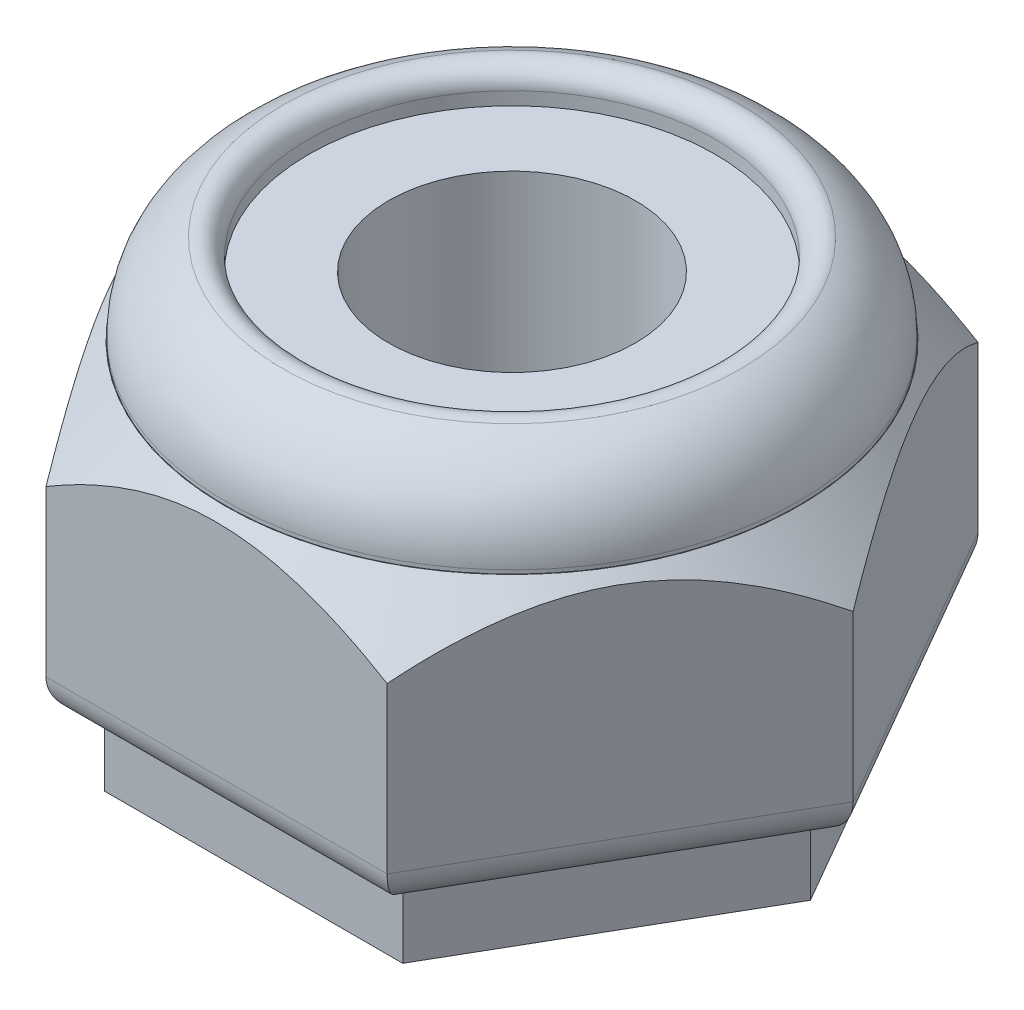
ISO-10303-21;
HEADER;
FILE_DESCRIPTION(('STEP AP214'),'2;1');
FILE_NAME('part.step','',(''),(''),'','','');
FILE_SCHEMA(('AUTOMOTIVE_DESIGN { 1 0 10303 214 1 1 1 1 }'));
ENDSEC;
DATA;
#1=APPLICATION_CONTEXT('core data for automotive mechanical design processes');
#2=APPLICATION_PROTOCOL_DEFINITION('international standard','automotive_design',2000,#1);
#3=PRODUCT_CONTEXT('',#1,'mechanical');
#4=PRODUCT('Part','Part','',(#3));
#5=PRODUCT_RELATED_PRODUCT_CATEGORY('part','',(#4));
#6=PRODUCT_DEFINITION_FORMATION('','',#4);
#7=PRODUCT_DEFINITION_CONTEXT('part definition',#1,'design');
#8=PRODUCT_DEFINITION('design','',#6,#7);
#9=PRODUCT_DEFINITION_SHAPE('','',#8);
#10=(LENGTH_UNIT() NAMED_UNIT(*) SI_UNIT(.MILLI.,.METRE.));
#11=(NAMED_UNIT(*) PLANE_ANGLE_UNIT() SI_UNIT($,.RADIAN.));
#12=(NAMED_UNIT(*) SI_UNIT($,.STERADIAN.) SOLID_ANGLE_UNIT());
#13=UNCERTAINTY_MEASURE_WITH_UNIT(LENGTH_MEASURE(1.E-05),#10,'distance_accuracy_value','');
#14=(GEOMETRIC_REPRESENTATION_CONTEXT(3) GLOBAL_UNCERTAINTY_ASSIGNED_CONTEXT((#13)) GLOBAL_UNIT_ASSIGNED_CONTEXT((#10,
#11,#12)) REPRESENTATION_CONTEXT('',''));
#15=CARTESIAN_POINT('',(0.,0.,0.));
#16=DIRECTION('',(0.,0.,1.));
#17=DIRECTION('',(1.,0.,0.));
#18=AXIS2_PLACEMENT_3D('',#15,#16,#17);
#19=CARTESIAN_POINT('',(0.,4.97840000000001,0.));
#20=DIRECTION('',(0.,-1.,0.));
#21=DIRECTION('',(1.,0.,0.));
#22=AXIS2_PLACEMENT_3D('',#19,#20,#21);
#23=CYLINDRICAL_SURFACE('',#22,3.93700000000001);
#24=CARTESIAN_POINT('',(0.,3.7084,0.));
#25=DIRECTION('',(0.,1.,0.));
#26=DIRECTION('',(-1.,0.,0.));
#27=AXIS2_PLACEMENT_3D('',#24,#25,#26);
#28=CIRCLE('',#27,3.937);
#29=CARTESIAN_POINT('',(-3.937,3.7084,0.));
#30=VERTEX_POINT('',#29);
#31=EDGE_CURVE('E142',#30,#30,#28,.T.);
#32=ORIENTED_EDGE('',*,*,#31,.F.);
#33=EDGE_LOOP('',(#32));
#34=FACE_BOUND('',#33,.T.);
#35=CARTESIAN_POINT('',(0.,3.6576,0.));
#36=DIRECTION('',(0.,-1.,0.));
#37=DIRECTION('',(1.,0.,0.));
#38=AXIS2_PLACEMENT_3D('',#35,#36,#37);
#39=CIRCLE('',#38,3.93700000000001);
#40=CARTESIAN_POINT('',(3.93700000000001,3.6576,0.));
#41=VERTEX_POINT('',#40);
#42=EDGE_CURVE('E20',#41,#41,#39,.F.);
#43=ORIENTED_EDGE('',*,*,#42,.T.);
#44=EDGE_LOOP('',(#43));
#45=FACE_BOUND('',#44,.T.);
#46=ADVANCED_FACE('F16',(#34,#45),#23,.T.);
#47=CARTESIAN_POINT('',(2.34315000000001,3.6576,4.05845484975502));
#48=DIRECTION('',(0.,-1.,0.));
#49=DIRECTION('',(1.,0.,0.));
#50=AXIS2_PLACEMENT_3D('',#47,#48,#49);
#51=PLANE('',#50);
#52=CARTESIAN_POINT('',(0.,3.65760000016735,0.));
#53=DIRECTION('',(0.,-1.,0.));
#54=DIRECTION('',(0.,0.,-1.));
#55=AXIS2_PLACEMENT_3D('',#52,#53,#54);
#56=CIRCLE('',#55,3.94407100938664);
#57=CARTESIAN_POINT('',(0.,3.65760000016735,-3.94407100938664));
#58=VERTEX_POINT('',#57);
#59=EDGE_CURVE('E141',#58,#58,#56,.T.);
#60=ORIENTED_EDGE('',*,*,#59,.F.);
#61=EDGE_LOOP('',(#60));
#62=FACE_BOUND('',#61,.T.);
#63=ORIENTED_EDGE('',*,*,#42,.F.);
#64=EDGE_LOOP('',(#63));
#65=FACE_BOUND('',#64,.T.);
#66=ADVANCED_FACE('F200',(#62,#65),#51,.F.);
#67=CARTESIAN_POINT('',(0.,3.70840000000008,0.));
#68=DIRECTION('',(0.,1.,0.));
#69=DIRECTION('',(0.,0.,1.));
#70=AXIS2_PLACEMENT_3D('',#67,#68,#69);
#71=TOROIDAL_SURFACE('',#70,2.66699999999999,1.27000000000001);
#72=ORIENTED_EDGE('',*,*,#31,.T.);
#73=EDGE_LOOP('',(#72));
#74=FACE_BOUND('',#73,.T.);
#75=CARTESIAN_POINT('',(0.,4.88572150982652,0.));
#76=DIRECTION('',(0.,1.,0.));
#77=DIRECTION('',(-1.,0.,0.));
#78=AXIS2_PLACEMENT_3D('',#75,#76,#77);
#79=CIRCLE('',#78,3.14325000000004);
#80=CARTESIAN_POINT('',(-3.14325000000003,4.88572150982652,0.));
#81=VERTEX_POINT('',#80);
#82=EDGE_CURVE('E121',#81,#81,#79,.T.);
#83=ORIENTED_EDGE('',*,*,#82,.F.);
#84=EDGE_LOOP('',(#83));
#85=FACE_BOUND('',#84,.T.);
#86=ADVANCED_FACE('F197',(#74,#85),#71,.T.);
#87=CARTESIAN_POINT('',(0.,2.76773860986168,0.));
#88=DIRECTION('',(0.,-1.,0.));
#89=DIRECTION('',(0.,0.,-1.));
#90=AXIS2_PLACEMENT_3D('',#87,#88,#89);
#91=CONICAL_SURFACE('',#90,4.69075337383629,0.698131700827581);
#92=CARTESIAN_POINT('',(-4.68630000002063,2.77304593408968,-5.5851817155357E-11));
#93=CARTESIAN_POINT('',(-4.65177717141987,2.81418235899122,0.0597952931143583));
#94=CARTESIAN_POINT('',(-4.61695780288894,2.85432113120693,0.120104208502788));
#95=CARTESIAN_POINT('',(-4.54666264441,2.93230661030783,0.241858994518482));
#96=CARTESIAN_POINT('',(-4.51118655193937,2.9701522247184,0.303305389130307));
#97=CARTESIAN_POINT('',(-4.40329561884235,3.0801870150985,0.490177966928205));
#98=CARTESIAN_POINT('',(-4.32983334003035,3.14837015585763,0.617418366271436));
#99=CARTESIAN_POINT('',(-4.17977964995295,3.27092778618679,0.877318981349457));
#100=CARTESIAN_POINT('',(-4.10317943930135,3.32525984895606,1.00999443806823));
#101=CARTESIAN_POINT('',(-3.94747591648453,3.41577217654512,1.2796808505042));
#102=CARTESIAN_POINT('',(-3.86837998240626,3.45200143021415,1.41667902699998));
#103=CARTESIAN_POINT('',(-3.73746585192525,3.49372811251008,1.64342895242181));
#104=CARTESIAN_POINT('',(-3.68614686015525,3.50560413722607,1.73231605356066));
#105=CARTESIAN_POINT('',(-3.58316406703978,3.52008140709636,1.910687483542));
#106=CARTESIAN_POINT('',(-3.53150020829175,3.52268106759616,2.00017191180866));
#107=CARTESIAN_POINT('',(-3.4285503454563,3.51847006530652,2.1784863048719));
#108=CARTESIAN_POINT('',(-3.37726380879505,3.51171021123823,2.26731719211343));
#109=CARTESIAN_POINT('',(-3.27519197702569,3.48921023560211,2.44411079075957));
#110=CARTESIAN_POINT('',(-3.224406707084,3.47346966546141,2.53207345857468));
#111=CARTESIAN_POINT('',(-3.10963060126893,3.42817062225528,2.73087150534129));
#112=CARTESIAN_POINT('',(-3.04589899568911,3.39598542078789,2.84125788425347));
#113=CARTESIAN_POINT('',(-2.92018166730183,3.32004827847368,3.05900668441208));
#114=CARTESIAN_POINT('',(-2.85819691952129,3.27629001415344,3.16636741686231));
#115=CARTESIAN_POINT('',(-2.7358890681865,3.1791036138555,3.37821082953874));
#116=CARTESIAN_POINT('',(-2.67557364726428,3.12563730729643,3.48268020305593));
#117=CARTESIAN_POINT('',(-2.55683004307658,3.01104764605198,3.68835015858288));
#118=CARTESIAN_POINT('',(-2.49840123076285,2.94992687744367,3.78955183013616));
#119=CARTESIAN_POINT('',(-2.42439626080902,2.86741854621722,3.91773219810881));
#120=CARTESIAN_POINT('',(-2.40802320097242,2.84883596647861,3.94609116962116));
#121=CARTESIAN_POINT('',(-2.3754621575828,2.81125673911825,4.00248855111944));
#122=CARTESIAN_POINT('',(-2.35927376439136,2.7922615116873,4.03052767061991));
#123=CARTESIAN_POINT('',(-2.34314999996957,2.77304593409365,4.05845484980773));
#124=B_SPLINE_CURVE_WITH_KNOTS('',3,(#92,#93,#94,#95,#96,#97,#98,#99,#100,#101,#102,#103,#104,
#105,#106,#107,#108,#109,#110,#111,#112,#113,#114,#115,#116,#117,#118,#119,#120,#121,#122,#123),
.UNSPECIFIED.,.F.,.F.,(4,2,2,2,2,2,2,2,2,2,2,2,2,2,2,4),(0.,0.241096809096306,0.482307589468028,
0.967637153878541,1.45443592247298,1.93991010962832,2.24950193441283,2.55914664334294,
2.86711700082692,3.17510274230014,3.56882084728694,3.96275452424868,4.35827201956431,
4.75365624709085,4.86660838996671,4.97921936903169),.UNSPECIFIED.);
#125=CARTESIAN_POINT('',(-4.68630000003129,2.77304593409263,1.36258849487727E-12));
#126=VERTEX_POINT('',#125);
#127=CARTESIAN_POINT('',(-2.34314999998476,2.77304593411176,4.05845484978141));
#128=VERTEX_POINT('',#127);
#129=EDGE_CURVE('E107',#126,#128,#124,.T.);
#130=ORIENTED_EDGE('',*,*,#129,.T.);
#131=CARTESIAN_POINT('',(-2.34315000006155,2.77304593408735,4.0584548497437));
#132=CARTESIAN_POINT('',(-2.27415972170866,2.81414935281164,4.05845484975083));
#133=CARTESIAN_POINT('',(-2.20457738522182,2.85425669894478,4.05845484975385));
#134=CARTESIAN_POINT('',(-2.06410193527611,2.93218331977878,4.05845484975614));
#135=CARTESIAN_POINT('',(-1.99320821640363,2.9700015014107,4.05845484975539));
#136=CARTESIAN_POINT('',(-1.77754688770714,3.07999086395974,4.05845484975419));
#137=CARTESIAN_POINT('',(-1.63068545867608,3.14815894046428,4.05845484975478));
#138=CARTESIAN_POINT('',(-1.3305275245436,3.27077676928304,4.05845484975521));
#139=CARTESIAN_POINT('',(-1.17720631605115,3.32516696813021,4.05845484975505));
#140=CARTESIAN_POINT('',(-0.86561350375334,3.41574608774384,4.05845484975494));
#141=CARTESIAN_POINT('',(-0.707359229251527,3.45199244882939,4.05845484975499));
#142=CARTESIAN_POINT('',(-0.456822143289689,3.49192146554132,4.058454849755));
#143=CARTESIAN_POINT('',(-0.365672921111748,3.50290887302486,4.058454849755));
#144=CARTESIAN_POINT('',(-0.183016321982132,3.51758027920227,4.058454849755));
#145=CARTESIAN_POINT('',(-0.0915105175139071,3.52128341043631,4.058454849755));
#146=CARTESIAN_POINT('',(0.104649468639837,3.52128177498356,4.058454849755));
#147=CARTESIAN_POINT('',(0.209305100868819,3.51643705340132,4.058454849755));
#148=CARTESIAN_POINT('',(0.417787181903716,3.49730239566766,4.058454849755));
#149=CARTESIAN_POINT('',(0.521613181345373,3.48300765118378,4.058454849755));
#150=CARTESIAN_POINT('',(0.728332544903489,3.44553375893286,4.058454849755));
#151=CARTESIAN_POINT('',(0.831215331547278,3.4222969773141,4.058454849755));
#152=CARTESIAN_POINT('',(1.03487580389782,3.36791830062304,4.058454849755));
#153=CARTESIAN_POINT('',(1.13565289467374,3.33677420329568,4.058454849755));
#154=CARTESIAN_POINT('',(1.33273383820815,3.26838741926302,4.058454849755));
#155=CARTESIAN_POINT('',(1.42908716224858,3.23128582693013,4.058454849755));
#156=CARTESIAN_POINT('',(1.61947291707491,3.15151071600647,4.058454849755));
#157=CARTESIAN_POINT('',(1.71350470709176,3.10883567908223,4.058454849755));
#158=CARTESIAN_POINT('',(1.89803195382149,3.01941532340772,4.058454849755));
#159=CARTESIAN_POINT('',(1.98855798046384,2.9727325573531,4.058454849755));
#160=CARTESIAN_POINT('',(2.16742834958516,2.87556944094008,4.058454849755));
#161=CARTESIAN_POINT('',(2.25577492893011,2.8250932194195,4.058454849755));
#162=CARTESIAN_POINT('',(2.34315000006327,2.77304593409223,4.058454849755));
#163=B_SPLINE_CURVE_WITH_KNOTS('',3,(#131,#132,#133,#134,#135,#136,#137,#138,#139,#140,#141,
#142,#143,#144,#145,#146,#147,#148,#149,#150,#151,#152,#153,#154,#155,#156,#157,#158,#159,#160,
#161,#162),.UNSPECIFIED.,.F.,.F.,(4,2,2,2,2,2,2,2,2,2,2,2,2,2,2,4),(0.,0.240903303567016,
0.481920744751272,0.967059466998938,1.45426068379578,1.93990959183257,2.21507934698528,
2.48952538388813,2.80337599595386,3.11738642358903,3.43345557970446,3.74961286053018,
4.05916118105052,4.36879400618447,4.67425708544416,4.97939238066899),.UNSPECIFIED.);
#164=CARTESIAN_POINT('',(2.34315000001685,2.77304593409264,4.05845484978141));
#165=VERTEX_POINT('',#164);
#166=EDGE_CURVE('E175',#128,#165,#163,.T.);
#167=ORIENTED_EDGE('',*,*,#166,.T.);
#168=CARTESIAN_POINT('',(2.34314999996197,2.77304593408969,4.05845484980079));
#169=CARTESIAN_POINT('',(2.37767282857373,2.81418235899124,3.99865955663693));
#170=CARTESIAN_POINT('',(2.41249219710932,2.85432113120694,3.93835064125119));
#171=CARTESIAN_POINT('',(2.48278735559178,2.93230661030784,3.81659585523753));
#172=CARTESIAN_POINT('',(2.51826344806127,2.97015222471841,3.75514946062505));
#173=CARTESIAN_POINT('',(2.62615438115643,3.0801870150985,3.56827688282608));
#174=CARTESIAN_POINT('',(2.69961665996934,3.14837015585764,3.44103648348338));
#175=CARTESIAN_POINT('',(2.8496703500474,3.27092778618679,3.18113586840574));
#176=CARTESIAN_POINT('',(2.92627056069876,3.32525984895606,3.04846041168683));
#177=CARTESIAN_POINT('',(3.08197408351539,3.41577217654512,2.77877399925076));
#178=CARTESIAN_POINT('',(3.16107001759374,3.45200143021415,2.64177582275502));
#179=CARTESIAN_POINT('',(3.29198414807477,3.49372811251008,2.4150258973332));
#180=CARTESIAN_POINT('',(3.34330313984477,3.50560413722607,2.32613879619435));
#181=CARTESIAN_POINT('',(3.44628593296023,3.52008140709636,2.147767366213));
#182=CARTESIAN_POINT('',(3.49794979170827,3.52268106759615,2.05828293794635));
#183=CARTESIAN_POINT('',(3.60089965454371,3.51847006530651,1.87996854488311));
#184=CARTESIAN_POINT('',(3.65218619120497,3.51171021123823,1.79113765764158));
#185=CARTESIAN_POINT('',(3.75425802297432,3.48921023560211,1.61434405899544));
#186=CARTESIAN_POINT('',(3.80504329291601,3.47346966546141,1.52638139118033));
#187=CARTESIAN_POINT('',(3.91981939873108,3.42817062225528,1.32758334441373));
#188=CARTESIAN_POINT('',(3.98355100431089,3.39598542078789,1.21719696550155));
#189=CARTESIAN_POINT('',(4.10926833269818,3.32004827847368,0.999448165342945));
#190=CARTESIAN_POINT('',(4.17125308047872,3.27629001415344,0.892087432892712));
#191=CARTESIAN_POINT('',(4.2935609318135,3.17910361385551,0.680244020216284));
#192=CARTESIAN_POINT('',(4.35387635273573,3.12563730729643,0.575774646699087));
#193=CARTESIAN_POINT('',(4.47261995692343,3.01104764605197,0.370104691172138));
#194=CARTESIAN_POINT('',(4.53104876923716,2.94992687744367,0.268903019618855));
#195=CARTESIAN_POINT('',(4.60505373919152,2.86741854621663,0.14072265164529));
#196=CARTESIAN_POINT('',(4.62142679902863,2.84883596647742,0.112363680132042));
#197=CARTESIAN_POINT('',(4.65398784241929,2.81125673911583,0.055966298631973));
#198=CARTESIAN_POINT('',(4.67017623561123,2.79226151168425,0.0279271791306273));
#199=CARTESIAN_POINT('',(4.68630000003353,2.77304593408996,-5.80666998558344E-11));
#200=B_SPLINE_CURVE_WITH_KNOTS('',3,(#168,#169,#170,#171,#172,#173,#174,#175,#176,#177,#178,
#179,#180,#181,#182,#183,#184,#185,#186,#187,#188,#189,#190,#191,#192,#193,#194,#195,#196,#197,
#198,#199),.UNSPECIFIED.,.F.,.F.,(4,2,2,2,2,2,2,2,2,2,2,2,2,2,2,4),(0.,0.241096809096303,
0.482307589468021,0.967637153878527,1.45443592247296,1.9399101096283,2.24950193441281,
2.55914664334292,2.8671170008269,3.17510274230012,3.56882084728691,3.96275452424864,
4.35827201956428,4.75365624709083,4.86660838997029,4.97921936903886),.UNSPECIFIED.);
#201=CARTESIAN_POINT('',(4.68630000002732,2.77304593409736,-1.0917840877275E-11));
#202=VERTEX_POINT('',#201);
#203=EDGE_CURVE('E183',#165,#202,#200,.T.);
#204=ORIENTED_EDGE('',*,*,#203,.T.);
#205=CARTESIAN_POINT('',(4.68630000001692,2.77304593410323,3.76267458844408E-11));
#206=CARTESIAN_POINT('',(4.65177717141278,2.8141823590028,-0.0597952931310414));
#207=CARTESIAN_POINT('',(4.61695780288054,2.85432113121737,-0.120104208518577));
#208=CARTESIAN_POINT('',(4.54666264440093,2.93230661031677,-0.241858994533079));
#209=CARTESIAN_POINT('',(4.51118655193091,2.97015222472698,-0.303305389144605));
#210=CARTESIAN_POINT('',(4.40329561883524,3.08018701510582,-0.490177966941427));
#211=CARTESIAN_POINT('',(4.32983334002344,3.14837015586387,-0.617418366283689));
#212=CARTESIAN_POINT('',(4.17977964994688,3.27092778619112,-0.877318981359809));
#213=CARTESIAN_POINT('',(4.10317943929591,3.32525984895958,-1.00999443807765));
#214=CARTESIAN_POINT('',(3.94747591648032,3.41577217654717,-1.27968085051162));
#215=CARTESIAN_POINT('',(3.86837998240263,3.45200143021556,-1.41667902700633));
#216=CARTESIAN_POINT('',(3.73746585192226,3.49372811251083,-1.64342895242706));
#217=CARTESIAN_POINT('',(3.68614686015226,3.50560413722664,-1.7323160535659));
#218=CARTESIAN_POINT('',(3.58316406703681,3.52008140709656,-1.91068748354721));
#219=CARTESIAN_POINT('',(3.53150020828879,3.52268106759618,-2.00017191181384));
#220=CARTESIAN_POINT('',(3.42855034545338,3.51847006530618,-2.17848630487702));
#221=CARTESIAN_POINT('',(3.37726380879215,3.51171021123772,-2.26731719211852));
#222=CARTESIAN_POINT('',(3.27519197702284,3.48921023560127,-2.44411079076458));
#223=CARTESIAN_POINT('',(3.22440670708118,3.47346966546041,-2.53207345857964));
#224=CARTESIAN_POINT('',(3.10963060126602,3.42817062225387,-2.73087150534641));
#225=CARTESIAN_POINT('',(3.04589899568608,3.39598542078622,-2.84125788425879));
#226=CARTESIAN_POINT('',(2.92018166729857,3.32004827847145,-3.05900668441778));
#227=CARTESIAN_POINT('',(2.85819691951793,3.27629001415092,-3.1663674168682));
#228=CARTESIAN_POINT('',(2.73588906818295,3.17910361385241,-3.37821082954497));
#229=CARTESIAN_POINT('',(2.67557364726063,3.12563730729304,-3.48268020306233));
#230=CARTESIAN_POINT('',(2.55683004307275,3.01104764604801,-3.68835015858959));
#231=CARTESIAN_POINT('',(2.49840123075893,2.94992687743942,-3.78955183014302));
#232=CARTESIAN_POINT('',(2.42439626080543,2.8674185462131,-3.91773219811509));
#233=CARTESIAN_POINT('',(2.40802320096925,2.84883596647492,-3.94609116962672));
#234=CARTESIAN_POINT('',(2.37546215758045,2.81125673911543,-4.00248855112358));
#235=CARTESIAN_POINT('',(2.35927376438942,2.79226151168493,-4.03052767062335));
#236=CARTESIAN_POINT('',(2.34314999996803,2.77304593409174,-4.05845484981047));
#237=B_SPLINE_CURVE_WITH_KNOTS('',3,(#205,#206,#207,#208,#209,#210,#211,#212,#213,#214,#215,
#216,#217,#218,#219,#220,#221,#222,#223,#224,#225,#226,#227,#228,#229,#230,#231,#232,#233,#234,
#235,#236),.UNSPECIFIED.,.F.,.F.,(4,2,2,2,2,2,2,2,2,2,2,2,2,2,2,4),(0.,0.241096809094276,
0.482307589464009,0.967637153870556,1.45443592246103,1.93991010961239,2.2495019343968,
2.55914664332681,2.86711700081071,3.17510274228384,3.56882084727151,3.96275452423413,
4.35827201955063,4.75365624707804,4.86660838995109,4.97921936901329),.UNSPECIFIED.);
#238=CARTESIAN_POINT('',(2.34315000001448,2.77304593409259,-4.05845484978282));
#239=VERTEX_POINT('',#238);
#240=EDGE_CURVE('E204',#202,#239,#237,.T.);
#241=ORIENTED_EDGE('',*,*,#240,.T.);
#242=CARTESIAN_POINT('',(2.34315000005868,2.77304593408962,-4.058454849745));
#243=CARTESIAN_POINT('',(2.2741597217057,2.81414935281353,-4.05845484975135));
#244=CARTESIAN_POINT('',(2.20457738521886,2.85425669894645,-4.05845484975405));
#245=CARTESIAN_POINT('',(2.06410193527325,2.93218331978018,-4.05845484975609));
#246=CARTESIAN_POINT('',(1.99320821640086,2.97000150141205,-4.05845484975542));
#247=CARTESIAN_POINT('',(1.77754688770464,3.07999086396089,-4.05845484975435));
#248=CARTESIAN_POINT('',(1.63068545867372,3.14815894046526,-4.05845484975488));
#249=CARTESIAN_POINT('',(1.33052752454156,3.2707767692837,-4.05845484975526));
#250=CARTESIAN_POINT('',(1.17720631604929,3.32516696813074,-4.05845484975512));
#251=CARTESIAN_POINT('',(0.865613503751842,3.41574608774412,-4.05845484975502));
#252=CARTESIAN_POINT('',(0.707359229250219,3.45199244882957,-4.05845484975506));
#253=CARTESIAN_POINT('',(0.456822143288761,3.49192146554135,-4.05845484975507));
#254=CARTESIAN_POINT('',(0.365672921111005,3.50290887302485,-4.05845484975507));
#255=CARTESIAN_POINT('',(0.183016321981762,3.5175802792022,-4.05845484975507));
#256=CARTESIAN_POINT('',(0.0915105175137235,3.52128341043623,-4.05845484975507));
#257=CARTESIAN_POINT('',(-0.104649468639836,3.52128177498348,-4.05845484975507));
#258=CARTESIAN_POINT('',(-0.209305100868819,3.51643705340124,-4.05845484975507));
#259=CARTESIAN_POINT('',(-0.41778718190372,3.49730239566758,-4.05845484975507));
#260=CARTESIAN_POINT('',(-0.521613181345379,3.48300765118369,-4.05845484975507));
#261=CARTESIAN_POINT('',(-0.728332544903499,3.44553375893278,-4.05845484975507));
#262=CARTESIAN_POINT('',(-0.831215331547289,3.42229697731402,-4.05845484975507));
#263=CARTESIAN_POINT('',(-1.03487580389784,3.36791830062295,-4.05845484975507));
#264=CARTESIAN_POINT('',(-1.13565289467376,3.3367742032956,-4.05845484975507));
#265=CARTESIAN_POINT('',(-1.33273383820816,3.26838741926293,-4.05845484975507));
#266=CARTESIAN_POINT('',(-1.42908716224858,3.23128582693005,-4.05845484975507));
#267=CARTESIAN_POINT('',(-1.61947291707489,3.1515107160064,-4.05845484975507));
#268=CARTESIAN_POINT('',(-1.71350470709174,3.10883567908216,-4.05845484975507));
#269=CARTESIAN_POINT('',(-1.89803195382145,3.01941532340766,-4.05845484975507));
#270=CARTESIAN_POINT('',(-1.9885579804638,2.97273255735305,-4.05845484975507));
#271=CARTESIAN_POINT('',(-2.1674283495851,2.87556944094004,-4.05845484975507));
#272=CARTESIAN_POINT('',(-2.25577492893005,2.82509321941947,-4.05845484975507));
#273=CARTESIAN_POINT('',(-2.3431500000632,2.7730459340922,-4.05845484975507));
#274=B_SPLINE_CURVE_WITH_KNOTS('',3,(#242,#243,#244,#245,#246,#247,#248,#249,#250,#251,#252,
#253,#254,#255,#256,#257,#258,#259,#260,#261,#262,#263,#264,#265,#266,#267,#268,#269,#270,#271,
#272,#273),.UNSPECIFIED.,.F.,.F.,(4,2,2,2,2,2,2,2,2,2,2,2,2,2,2,4),(0.,0.240903303566687,
0.481920744750623,0.967059466997657,1.45426068379387,1.93990959183004,2.21507934698218,
2.48952538388447,2.80337599595021,3.11738642358539,3.43345557970082,3.74961286052654,
4.05916118104685,4.36879400618078,4.67425708544044,4.97939238066524),.UNSPECIFIED.);
#275=CARTESIAN_POINT('',(-2.34315000001679,2.77304593409261,-4.05845484978147));
#276=VERTEX_POINT('',#275);
#277=EDGE_CURVE('E110',#239,#276,#274,.T.);
#278=ORIENTED_EDGE('',*,*,#277,.T.);
#279=CARTESIAN_POINT('',(-2.34314999996192,2.77304593408966,-4.05845484980084));
#280=CARTESIAN_POINT('',(-2.37767282857368,2.81418235899121,-3.99865955663698));
#281=CARTESIAN_POINT('',(-2.41249219710928,2.85432113120691,-3.93835064125125));
#282=CARTESIAN_POINT('',(-2.48278735559174,2.93230661030781,-3.81659585523759));
#283=CARTESIAN_POINT('',(-2.51826344806123,2.97015222471838,-3.7551494606251));
#284=CARTESIAN_POINT('',(-2.62615438115639,3.08018701509849,-3.56827688282613));
#285=CARTESIAN_POINT('',(-2.6996166599693,3.14837015585762,-3.44103648348342));
#286=CARTESIAN_POINT('',(-2.84967035004737,3.27092778618678,-3.18113586840577));
#287=CARTESIAN_POINT('',(-2.92627056069873,3.32525984895606,-3.04846041168686));
#288=CARTESIAN_POINT('',(-3.08197408351537,3.41577217654512,-2.77877399925078));
#289=CARTESIAN_POINT('',(-3.16107001759372,3.45200143021415,-2.64177582275504));
#290=CARTESIAN_POINT('',(-3.29198414807476,3.49372811251009,-2.41502589733322));
#291=CARTESIAN_POINT('',(-3.34330313984475,3.50560413722608,-2.32613879619437));
#292=CARTESIAN_POINT('',(-3.44628593296022,3.52008140709636,-2.14776736621302));
#293=CARTESIAN_POINT('',(-3.49794979170825,3.52268106759616,-2.05828293794636));
#294=CARTESIAN_POINT('',(-3.6008996545437,3.51847006530652,-1.87996854488312));
#295=CARTESIAN_POINT('',(-3.65218619120495,3.51171021123824,-1.79113765764159));
#296=CARTESIAN_POINT('',(-3.7542580229743,3.48921023560212,-1.61434405899545));
#297=CARTESIAN_POINT('',(-3.80504329291599,3.47346966546142,-1.52638139118034));
#298=CARTESIAN_POINT('',(-3.91981939873106,3.42817062225528,-1.32758334441374));
#299=CARTESIAN_POINT('',(-3.98355100431088,3.3959854207879,-1.21719696550156));
#300=CARTESIAN_POINT('',(-4.10926833269817,3.32004827847369,-0.999448165342954));
#301=CARTESIAN_POINT('',(-4.1712530804787,3.27629001415345,-0.89208743289272));
#302=CARTESIAN_POINT('',(-4.29356093181349,3.17910361385552,-0.680244020216292));
#303=CARTESIAN_POINT('',(-4.35387635273571,3.12563730729644,-0.575774646699097));
#304=CARTESIAN_POINT('',(-4.47261995692341,3.01104764605199,-0.370104691172152));
#305=CARTESIAN_POINT('',(-4.53104876923714,2.94992687744368,-0.26890301961887));
#306=CARTESIAN_POINT('',(-4.60505373919125,2.86741854621693,-0.14072265164575));
#307=CARTESIAN_POINT('',(-4.62142679902811,2.84883596647801,-0.112363680132942));
#308=CARTESIAN_POINT('',(-4.65398784241826,2.81125673911702,-0.0559662986337416));
#309=CARTESIAN_POINT('',(-4.67017623560996,2.79226151168575,-0.0279271791328252));
#310=CARTESIAN_POINT('',(-4.68630000003201,2.77304593409177,5.54427484235605E-11));
#311=B_SPLINE_CURVE_WITH_KNOTS('',3,(#279,#280,#281,#282,#283,#284,#285,#286,#287,#288,#289,
#290,#291,#292,#293,#294,#295,#296,#297,#298,#299,#300,#301,#302,#303,#304,#305,#306,#307,#308,
#309,#310),.UNSPECIFIED.,.F.,.F.,(4,2,2,2,2,2,2,2,2,2,2,2,2,2,2,4),(0.,0.24109680909631,
0.482307589468037,0.967637153878559,1.45443592247301,1.93991010962836,2.24950193441287,
2.55914664334298,2.86711700082697,3.17510274230018,3.56882084728698,3.96275452424871,
4.35827201956434,4.75365624709089,4.86660838996859,4.97921936903541),.UNSPECIFIED.);
#312=EDGE_CURVE('E103',#276,#126,#311,.T.);
#313=ORIENTED_EDGE('',*,*,#312,.T.);
#314=EDGE_LOOP('',(#130,#167,#204,#241,#278,#313));
#315=FACE_BOUND('',#314,.T.);
#316=ORIENTED_EDGE('',*,*,#59,.T.);
#317=EDGE_LOOP('',(#316));
#318=FACE_BOUND('',#317,.T.);
#319=ADVANCED_FACE('F105',(#315,#318),#91,.T.);
#320=CARTESIAN_POINT('',(0.,4.65025720786122,0.));
#321=DIRECTION('',(0.,-1.,0.));
#322=DIRECTION('',(1.,0.,0.));
#323=AXIS2_PLACEMENT_3D('',#320,#321,#322);
#324=TOROIDAL_SURFACE('',#323,3.04800000000006,0.254);
#325=CARTESIAN_POINT('',(0.,4.65025720786115,0.));
#326=DIRECTION('',(0.,1.,0.));
#327=DIRECTION('',(-1.,0.,0.));
#328=AXIS2_PLACEMENT_3D('',#325,#326,#327);
#329=CIRCLE('',#328,2.79400000000001);
#330=CARTESIAN_POINT('',(-2.79400000000001,4.65025720786115,0.));
#331=VERTEX_POINT('',#330);
#332=EDGE_CURVE('E134',#331,#331,#329,.F.);
#333=ORIENTED_EDGE('',*,*,#332,.T.);
#334=EDGE_LOOP('',(#333));
#335=FACE_BOUND('',#334,.T.);
#336=ORIENTED_EDGE('',*,*,#82,.T.);
#337=EDGE_LOOP('',(#336));
#338=FACE_BOUND('',#337,.T.);
#339=ADVANCED_FACE('F18',(#335,#338),#324,.T.);
#340=CARTESIAN_POINT('',(-4.6863,3.6576,0.));
#341=DIRECTION('',(0.866025403784439,0.,-0.5));
#342=DIRECTION('',(-0.5,0.,-0.866025403784439));
#343=AXIS2_PLACEMENT_3D('',#340,#341,#342);
#344=PLANE('',#343);
#345=DIRECTION('',(0.,1.,0.));
#346=VECTOR('',#345,1.);
#347=CARTESIAN_POINT('',(-2.34315,3.6576,4.058454849755));
#348=LINE('',#347,#346);
#349=CARTESIAN_POINT('',(-2.34315000000001,0.507999999999995,4.05845484975499));
#350=VERTEX_POINT('',#349);
#351=EDGE_CURVE('E120',#350,#128,#348,.T.);
#352=ORIENTED_EDGE('',*,*,#351,.T.);
#353=ORIENTED_EDGE('',*,*,#129,.F.);
#354=DIRECTION('',(0.,1.,0.));
#355=VECTOR('',#354,1.);
#356=CARTESIAN_POINT('',(-4.6863000000071,3.6576,1.22922505507717E-11));
#357=LINE('',#356,#355);
#358=CARTESIAN_POINT('',(-4.68630000000355,0.507999999999995,6.14200530713038E-12));
#359=VERTEX_POINT('',#358);
#360=EDGE_CURVE('E114',#126,#359,#357,.F.);
#361=ORIENTED_EDGE('',*,*,#360,.T.);
#362=DIRECTION('',(-0.5,0.,-0.866025403784439));
#363=VECTOR('',#362,1.);
#364=CARTESIAN_POINT('',(-4.68630000000001,0.507999999999995,0.));
#365=LINE('',#364,#363);
#366=EDGE_CURVE('E137',#350,#359,#365,.T.);
#367=ORIENTED_EDGE('',*,*,#366,.F.);
#368=EDGE_LOOP('',(#352,#353,#361,#367));
#369=FACE_BOUND('',#368,.T.);
#370=ADVANCED_FACE('F117',(#369),#344,.F.);
#371=CARTESIAN_POINT('',(-2.34315,3.6576,-4.05845484975501));
#372=DIRECTION('',(0.866025403784439,0.,0.5));
#373=DIRECTION('',(0.5,0.,-0.866025403784439));
#374=AXIS2_PLACEMENT_3D('',#371,#372,#373);
#375=PLANE('',#374);
#376=ORIENTED_EDGE('',*,*,#360,.F.);
#377=ORIENTED_EDGE('',*,*,#312,.F.);
#378=DIRECTION('',(0.,1.,0.));
#379=VECTOR('',#378,1.);
#380=CARTESIAN_POINT('',(-2.34315000001417,3.6576,-4.05845484975507));
#381=LINE('',#380,#379);
#382=CARTESIAN_POINT('',(-2.34315000000708,0.507999999999994,-4.05845484975504));
#383=VERTEX_POINT('',#382);
#384=EDGE_CURVE('E129',#276,#383,#381,.F.);
#385=ORIENTED_EDGE('',*,*,#384,.T.);
#386=DIRECTION('',(0.5,0.,-0.866025403784439));
#387=VECTOR('',#386,1.);
#388=CARTESIAN_POINT('',(-2.34315,0.507999999999995,-4.05845484975502));
#389=LINE('',#388,#387);
#390=EDGE_CURVE('E126',#359,#383,#389,.T.);
#391=ORIENTED_EDGE('',*,*,#390,.F.);
#392=EDGE_LOOP('',(#376,#377,#385,#391));
#393=FACE_BOUND('',#392,.T.);
#394=ADVANCED_FACE('F124',(#393),#375,.F.);
#395=CARTESIAN_POINT('',(2.34315000000001,3.6576,-4.05845484975507));
#396=DIRECTION('',(0.,0.,1.));
#397=DIRECTION('',(1.,0.,0.));
#398=AXIS2_PLACEMENT_3D('',#395,#396,#397);
#399=PLANE('',#398);
#400=ORIENTED_EDGE('',*,*,#384,.F.);
#401=ORIENTED_EDGE('',*,*,#277,.F.);
#402=DIRECTION('',(0.,1.,0.));
#403=VECTOR('',#402,1.);
#404=CARTESIAN_POINT('',(2.34314999999293,3.6576,-4.05845484976733));
#405=LINE('',#404,#403);
#406=CARTESIAN_POINT('',(2.34314999999648,0.507999999999995,-4.05845484976118));
#407=VERTEX_POINT('',#406);
#408=EDGE_CURVE('E516',#239,#407,#405,.F.);
#409=ORIENTED_EDGE('',*,*,#408,.T.);
#410=DIRECTION('',(1.,0.,0.));
#411=VECTOR('',#410,1.);
#412=CARTESIAN_POINT('',(2.34315,0.507999999999994,-4.05845484975503));
#413=LINE('',#412,#411);
#414=EDGE_CURVE('E169',#383,#407,#413,.T.);
#415=ORIENTED_EDGE('',*,*,#414,.F.);
#416=EDGE_LOOP('',(#400,#401,#409,#415));
#417=FACE_BOUND('',#416,.T.);
#418=ADVANCED_FACE('F348',(#417),#399,.F.);
#419=CARTESIAN_POINT('',(4.68630000000002,3.6576,0.));
#420=DIRECTION('',(-0.866025403784439,0.,0.5));
#421=DIRECTION('',(0.5,0.,0.866025403784439));
#422=AXIS2_PLACEMENT_3D('',#419,#420,#421);
#423=PLANE('',#422);
#424=ORIENTED_EDGE('',*,*,#408,.F.);
#425=ORIENTED_EDGE('',*,*,#240,.F.);
#426=DIRECTION('',(0.,1.,0.));
#427=VECTOR('',#426,1.);
#428=CARTESIAN_POINT('',(4.68630000001422,3.6576,-2.46174608475869E-11));
#429=LINE('',#428,#427);
#430=CARTESIAN_POINT('',(4.68630000000712,0.508000000000008,-1.23196537606812E-11));
#431=VERTEX_POINT('',#430);
#432=EDGE_CURVE('E508',#202,#431,#429,.F.);
#433=ORIENTED_EDGE('',*,*,#432,.T.);
#434=DIRECTION('',(0.5,0.,0.866025403784439));
#435=VECTOR('',#434,1.);
#436=CARTESIAN_POINT('',(4.68630000000002,0.507999999999995,0.));
#437=LINE('',#436,#435);
#438=EDGE_CURVE('E165',#407,#431,#437,.T.);
#439=ORIENTED_EDGE('',*,*,#438,.F.);
#440=EDGE_LOOP('',(#424,#425,#433,#439));
#441=FACE_BOUND('',#440,.T.);
#442=ADVANCED_FACE('F354',(#441),#423,.F.);
#443=CARTESIAN_POINT('',(2.34315000000001,3.6576,4.05845484975502));
#444=DIRECTION('',(-0.866025403784439,0.,-0.499999999999999));
#445=DIRECTION('',(-0.499999999999999,0.,0.866025403784439));
#446=AXIS2_PLACEMENT_3D('',#443,#444,#445);
#447=PLANE('',#446);
#448=ORIENTED_EDGE('',*,*,#432,.F.);
#449=ORIENTED_EDGE('',*,*,#203,.F.);
#450=DIRECTION('',(0.,1.,0.));
#451=VECTOR('',#450,1.);
#452=CARTESIAN_POINT('',(2.34315000001423,3.6576,4.058454849755));
#453=LINE('',#452,#451);
#454=CARTESIAN_POINT('',(2.34315000000713,0.507999999999995,4.05845484975499));
#455=VERTEX_POINT('',#454);
#456=EDGE_CURVE('E138',#165,#455,#453,.F.);
#457=ORIENTED_EDGE('',*,*,#456,.T.);
#458=DIRECTION('',(-0.499999999999999,0.,0.866025403784439));
#459=VECTOR('',#458,1.);
#460=CARTESIAN_POINT('',(2.34315000000003,0.508000000000008,4.05845484975498));
#461=LINE('',#460,#459);
#462=EDGE_CURVE('E161',#431,#455,#461,.T.);
#463=ORIENTED_EDGE('',*,*,#462,.F.);
#464=EDGE_LOOP('',(#448,#449,#457,#463));
#465=FACE_BOUND('',#464,.T.);
#466=ADVANCED_FACE('F308',(#465),#447,.F.);
#467=CARTESIAN_POINT('',(-2.34315000000002,3.6576,4.058454849755));
#468=DIRECTION('',(0.,0.,-1.));
#469=DIRECTION('',(-1.,0.,0.));
#470=AXIS2_PLACEMENT_3D('',#467,#468,#469);
#471=PLANE('',#470);
#472=ORIENTED_EDGE('',*,*,#456,.F.);
#473=ORIENTED_EDGE('',*,*,#166,.F.);
#474=ORIENTED_EDGE('',*,*,#351,.F.);
#475=DIRECTION('',(-1.,0.,0.));
#476=VECTOR('',#475,1.);
#477=CARTESIAN_POINT('',(-2.34315,0.507999999999995,4.05845484975498));
#478=LINE('',#477,#476);
#479=EDGE_CURVE('E157',#455,#350,#478,.T.);
#480=ORIENTED_EDGE('',*,*,#479,.F.);
#481=EDGE_LOOP('',(#472,#473,#474,#480));
#482=FACE_BOUND('',#481,.T.);
#483=ADVANCED_FACE('F190',(#482),#471,.F.);
#484=CARTESIAN_POINT('',(0.,4.4704,0.));
#485=DIRECTION('',(0.,1.,0.));
#486=DIRECTION('',(-1.,0.,0.));
#487=AXIS2_PLACEMENT_3D('',#484,#485,#486);
#488=CYLINDRICAL_SURFACE('',#487,2.79400000000001);
#489=ORIENTED_EDGE('',*,*,#332,.F.);
#490=EDGE_LOOP('',(#489));
#491=FACE_BOUND('',#490,.T.);
#492=CARTESIAN_POINT('',(0.,4.4704,0.));
#493=DIRECTION('',(0.,1.,0.));
#494=DIRECTION('',(-1.,0.,0.));
#495=AXIS2_PLACEMENT_3D('',#492,#493,#494);
#496=CIRCLE('',#495,2.79400000000001);
#497=CARTESIAN_POINT('',(-2.79400000000001,4.4704,0.));
#498=VERTEX_POINT('',#497);
#499=EDGE_CURVE('E150',#498,#498,#496,.T.);
#500=ORIENTED_EDGE('',*,*,#499,.F.);
#501=EDGE_LOOP('',(#500));
#502=FACE_BOUND('',#501,.T.);
#503=ADVANCED_FACE('F301',(#491,#502),#488,.F.);
#504=CARTESIAN_POINT('',(-4.24635909487751,0.507999999999995,-0.254000000000011));
#505=DIRECTION('',(-0.5,0.,-0.866025403784439));
#506=DIRECTION('',(-0.866025403784439,0.,0.5));
#507=AXIS2_PLACEMENT_3D('',#504,#505,#506);
#508=CYLINDRICAL_SURFACE('',#507,0.508000000000002);
#509=CARTESIAN_POINT('',(-4.09971212650334,0.507999999999995,0.));
#510=DIRECTION('',(0.,0.,-1.));
#511=DIRECTION('',(1.,0.,0.));
#512=AXIS2_PLACEMENT_3D('',#509,#510,#511);
#513=ELLIPSE('',#512,0.586587873496662,0.508000000000002);
#514=CARTESIAN_POINT('',(-4.09971212650335,0.,0.));
#515=VERTEX_POINT('',#514);
#516=EDGE_CURVE('E173',#515,#359,#513,.T.);
#517=ORIENTED_EDGE('',*,*,#516,.F.);
#518=DIRECTION('',(-0.5,0.,-0.866025403784439));
#519=VECTOR('',#518,1.);
#520=CARTESIAN_POINT('',(-2.04985606325168,0.,3.55045484975499));
#521=LINE('',#520,#519);
#522=CARTESIAN_POINT('',(-2.04985606325168,0.,3.55045484975498));
#523=VERTEX_POINT('',#522);
#524=EDGE_CURVE('E153',#515,#523,#521,.F.);
#525=ORIENTED_EDGE('',*,*,#524,.T.);
#526=CARTESIAN_POINT('',(-2.04985606325169,0.507999999999995,3.55045484975498));
#527=DIRECTION('',(-0.866025403784438,0.,-0.5));
#528=DIRECTION('',(-0.5,0.,0.866025403784438));
#529=AXIS2_PLACEMENT_3D('',#526,#527,#528);
#530=ELLIPSE('',#529,0.586587873496662,0.508000000000002);
#531=EDGE_CURVE('E154',#350,#523,#530,.F.);
#532=ORIENTED_EDGE('',*,*,#531,.F.);
#533=ORIENTED_EDGE('',*,*,#366,.T.);
#534=EDGE_LOOP('',(#517,#525,#532,#533));
#535=FACE_BOUND('',#534,.T.);
#536=ADVANCED_FACE('F298',(#535),#508,.T.);
#537=CARTESIAN_POINT('',(-1.9032090948775,0.507999999999995,-3.80445484975502));
#538=DIRECTION('',(0.5,0.,-0.866025403784439));
#539=DIRECTION('',(-0.866025403784439,0.,-0.5));
#540=AXIS2_PLACEMENT_3D('',#537,#538,#539);
#541=CYLINDRICAL_SURFACE('',#540,0.508000000000002);
#542=CARTESIAN_POINT('',(-2.04985606325166,0.508000000000002,-3.55045484975503));
#543=DIRECTION('',(0.866025403784439,0.,-0.5));
#544=DIRECTION('',(0.5,0.,0.866025403784439));
#545=AXIS2_PLACEMENT_3D('',#542,#543,#544);
#546=ELLIPSE('',#545,0.586587873496661,0.508000000000002);
#547=CARTESIAN_POINT('',(-2.04985606325168,0.,-3.55045484975506));
#548=VERTEX_POINT('',#547);
#549=EDGE_CURVE('E170',#548,#383,#546,.T.);
#550=ORIENTED_EDGE('',*,*,#549,.F.);
#551=DIRECTION('',(0.5,0.,-0.866025403784439));
#552=VECTOR('',#551,1.);
#553=CARTESIAN_POINT('',(-4.09971212650335,0.,0.));
#554=LINE('',#553,#552);
#555=EDGE_CURVE('E538',#548,#515,#554,.F.);
#556=ORIENTED_EDGE('',*,*,#555,.T.);
#557=ORIENTED_EDGE('',*,*,#516,.T.);
#558=ORIENTED_EDGE('',*,*,#390,.T.);
#559=EDGE_LOOP('',(#550,#556,#557,#558));
#560=FACE_BOUND('',#559,.T.);
#561=ADVANCED_FACE('F294',(#560),#541,.T.);
#562=CARTESIAN_POINT('',(2.34315,0.508000000000008,-3.55045484975503));
#563=DIRECTION('',(1.,0.,0.));
#564=DIRECTION('',(0.,1.,0.));
#565=AXIS2_PLACEMENT_3D('',#562,#563,#564);
#566=CYLINDRICAL_SURFACE('',#565,0.508000000000002);
#567=CARTESIAN_POINT('',(2.04985606325169,0.508000000000002,-3.55045484975503));
#568=DIRECTION('',(0.866025403784438,0.,0.5));
#569=DIRECTION('',(-0.5,0.,0.866025403784439));
#570=AXIS2_PLACEMENT_3D('',#567,#568,#569);
#571=ELLIPSE('',#570,0.586587873496662,0.508000000000002);
#572=CARTESIAN_POINT('',(2.04985606325168,0.,-3.55045484975508));
#573=VERTEX_POINT('',#572);
#574=EDGE_CURVE('E166',#573,#407,#571,.T.);
#575=ORIENTED_EDGE('',*,*,#574,.F.);
#576=DIRECTION('',(1.,0.,0.));
#577=VECTOR('',#576,1.);
#578=CARTESIAN_POINT('',(-2.04985606325165,0.,-3.55045484975508));
#579=LINE('',#578,#577);
#580=EDGE_CURVE('E527',#573,#548,#579,.F.);
#581=ORIENTED_EDGE('',*,*,#580,.T.);
#582=ORIENTED_EDGE('',*,*,#549,.T.);
#583=ORIENTED_EDGE('',*,*,#414,.T.);
#584=EDGE_LOOP('',(#575,#581,#582,#583));
#585=FACE_BOUND('',#584,.T.);
#586=ADVANCED_FACE('F290',(#585),#566,.T.);
#587=CARTESIAN_POINT('',(4.24635909487753,0.507999999999995,0.253999999999983));
#588=DIRECTION('',(0.5,0.,0.866025403784439));
#589=DIRECTION('',(0.866025403784439,0.,-0.5));
#590=AXIS2_PLACEMENT_3D('',#587,#588,#589);
#591=CYLINDRICAL_SURFACE('',#590,0.508000000000002);
#592=ORIENTED_EDGE('',*,*,#574,.T.);
#593=ORIENTED_EDGE('',*,*,#438,.T.);
#594=CARTESIAN_POINT('',(4.09971212650336,0.508000000000002,0.));
#595=DIRECTION('',(0.,0.,1.));
#596=DIRECTION('',(-1.,0.,0.));
#597=AXIS2_PLACEMENT_3D('',#594,#595,#596);
#598=ELLIPSE('',#597,0.586587873496662,0.508000000000002);
#599=CARTESIAN_POINT('',(4.09971212650335,0.,0.));
#600=VERTEX_POINT('',#599);
#601=EDGE_CURVE('E162',#600,#431,#598,.T.);
#602=ORIENTED_EDGE('',*,*,#601,.F.);
#603=DIRECTION('',(0.5,0.,0.866025403784439));
#604=VECTOR('',#603,1.);
#605=CARTESIAN_POINT('',(2.04985606325167,0.,-3.55045484975502));
#606=LINE('',#605,#604);
#607=EDGE_CURVE('E591',#600,#573,#606,.F.);
#608=ORIENTED_EDGE('',*,*,#607,.T.);
#609=EDGE_LOOP('',(#592,#593,#602,#608));
#610=FACE_BOUND('',#609,.T.);
#611=ADVANCED_FACE('F286',(#610),#591,.T.);
#612=CARTESIAN_POINT('',(1.90320909487753,0.508000000000008,3.80445484975498));
#613=DIRECTION('',(-0.499999999999999,0.,0.866025403784439));
#614=DIRECTION('',(0.866025403784439,0.,0.499999999999999));
#615=AXIS2_PLACEMENT_3D('',#612,#613,#614);
#616=CYLINDRICAL_SURFACE('',#615,0.508000000000002);
#617=ORIENTED_EDGE('',*,*,#601,.T.);
#618=ORIENTED_EDGE('',*,*,#462,.T.);
#619=CARTESIAN_POINT('',(2.0498560632517,0.508000000000002,3.55045484975498));
#620=DIRECTION('',(-0.866025403784439,0.,0.5));
#621=DIRECTION('',(-0.5,0.,-0.866025403784439));
#622=AXIS2_PLACEMENT_3D('',#619,#620,#621);
#623=ELLIPSE('',#622,0.586587873496662,0.508000000000002);
#624=CARTESIAN_POINT('',(2.0498560632517,0.,3.55045484975498));
#625=VERTEX_POINT('',#624);
#626=EDGE_CURVE('E158',#625,#455,#623,.T.);
#627=ORIENTED_EDGE('',*,*,#626,.F.);
#628=DIRECTION('',(-0.499999999999999,0.,0.866025403784439));
#629=VECTOR('',#628,1.);
#630=CARTESIAN_POINT('',(4.09971212650336,0.,0.));
#631=LINE('',#630,#629);
#632=EDGE_CURVE('E567',#625,#600,#631,.F.);
#633=ORIENTED_EDGE('',*,*,#632,.T.);
#634=EDGE_LOOP('',(#617,#618,#627,#633));
#635=FACE_BOUND('',#634,.T.);
#636=ADVANCED_FACE('F282',(#635),#616,.T.);
#637=CARTESIAN_POINT('',(-2.34315,0.507999999999995,3.55045484975498));
#638=DIRECTION('',(-1.,0.,0.));
#639=DIRECTION('',(0.,0.,1.));
#640=AXIS2_PLACEMENT_3D('',#637,#638,#639);
#641=CYLINDRICAL_SURFACE('',#640,0.508000000000002);
#642=ORIENTED_EDGE('',*,*,#531,.T.);
#643=DIRECTION('',(-1.,0.,0.));
#644=VECTOR('',#643,1.);
#645=CARTESIAN_POINT('',(2.04985606325167,0.,3.55045484975498));
#646=LINE('',#645,#644);
#647=EDGE_CURVE('E149',#523,#625,#646,.F.);
#648=ORIENTED_EDGE('',*,*,#647,.T.);
#649=ORIENTED_EDGE('',*,*,#626,.T.);
#650=ORIENTED_EDGE('',*,*,#479,.T.);
#651=EDGE_LOOP('',(#642,#648,#649,#650));
#652=FACE_BOUND('',#651,.T.);
#653=ADVANCED_FACE('F278',(#652),#641,.T.);
#654=CARTESIAN_POINT('',(0.,4.4704,0.));
#655=DIRECTION('',(0.,1.,0.));
#656=DIRECTION('',(-1.,0.,0.));
#657=AXIS2_PLACEMENT_3D('',#654,#655,#656);
#658=PLANE('',#657);
#659=ORIENTED_EDGE('',*,*,#499,.T.);
#660=EDGE_LOOP('',(#659));
#661=FACE_BOUND('',#660,.T.);
#662=CARTESIAN_POINT('',(0.,4.4704,0.));
#663=DIRECTION('',(0.,1.,0.));
#664=DIRECTION('',(-1.,0.,0.));
#665=AXIS2_PLACEMENT_3D('',#662,#663,#664);
#666=CIRCLE('',#665,1.69545000000001);
#667=CARTESIAN_POINT('',(-1.69545000000001,4.4704,0.));
#668=VERTEX_POINT('',#667);
#669=EDGE_CURVE('E145',#668,#668,#666,.F.);
#670=ORIENTED_EDGE('',*,*,#669,.T.);
#671=EDGE_LOOP('',(#670));
#672=FACE_BOUND('',#671,.T.);
#673=ADVANCED_FACE('F274',(#661,#672),#658,.T.);
#674=CARTESIAN_POINT('',(-2.04985606325168,-0.956309999999953,3.55045484975499));
#675=DIRECTION('',(0.866025403784439,0.,-0.5));
#676=DIRECTION('',(-0.5,0.,-0.866025403784439));
#677=AXIS2_PLACEMENT_3D('',#674,#675,#676);
#678=PLANE('',#677);
#679=DIRECTION('',(0.,1.,0.));
#680=VECTOR('',#679,1.);
#681=CARTESIAN_POINT('',(-4.09971212650335,-0.956309999999919,0.));
#682=LINE('',#681,#680);
#683=CARTESIAN_POINT('',(-4.09971212650335,-0.956309999999924,0.));
#684=VERTEX_POINT('',#683);
#685=EDGE_CURVE('E540',#515,#684,#682,.F.);
#686=ORIENTED_EDGE('',*,*,#685,.T.);
#687=DIRECTION('',(-0.500000000000002,0.,-0.866025403784438));
#688=VECTOR('',#687,1.);
#689=CARTESIAN_POINT('',(-2.04985606325168,-0.956309999999919,3.55045484975499));
#690=LINE('',#689,#688);
#691=CARTESIAN_POINT('',(-2.04985606325168,-0.956309999999936,3.55045484975498));
#692=VERTEX_POINT('',#691);
#693=EDGE_CURVE('E148',#692,#684,#690,.T.);
#694=ORIENTED_EDGE('',*,*,#693,.F.);
#695=DIRECTION('',(0.,1.,0.));
#696=VECTOR('',#695,1.);
#697=CARTESIAN_POINT('',(-2.04985606325168,-0.956309999999919,3.55045484975498));
#698=LINE('',#697,#696);
#699=EDGE_CURVE('E563',#692,#523,#698,.T.);
#700=ORIENTED_EDGE('',*,*,#699,.T.);
#701=ORIENTED_EDGE('',*,*,#524,.F.);
#702=EDGE_LOOP('',(#686,#694,#700,#701));
#703=FACE_BOUND('',#702,.T.);
#704=ADVANCED_FACE('F270',(#703),#678,.F.);
#705=CARTESIAN_POINT('',(-4.09971212650335,-0.956309999999919,0.));
#706=DIRECTION('',(0.866025403784439,0.,0.5));
#707=DIRECTION('',(0.5,0.,-0.866025403784439));
#708=AXIS2_PLACEMENT_3D('',#705,#706,#707);
#709=PLANE('',#708);
#710=DIRECTION('',(0.,1.,0.));
#711=VECTOR('',#710,1.);
#712=CARTESIAN_POINT('',(-2.04985606325166,-0.956309999999912,-3.55045484975508));
#713=LINE('',#712,#711);
#714=CARTESIAN_POINT('',(-2.04985606325165,-0.956309999999918,-3.55045484975508));
#715=VERTEX_POINT('',#714);
#716=EDGE_CURVE('E531',#548,#715,#713,.F.);
#717=ORIENTED_EDGE('',*,*,#716,.T.);
#718=DIRECTION('',(0.499999999999997,0.,-0.866025403784441));
#719=VECTOR('',#718,1.);
#720=CARTESIAN_POINT('',(-4.09971212650335,-0.956309999999919,0.));
#721=LINE('',#720,#719);
#722=EDGE_CURVE('E546',#684,#715,#721,.T.);
#723=ORIENTED_EDGE('',*,*,#722,.F.);
#724=ORIENTED_EDGE('',*,*,#685,.F.);
#725=ORIENTED_EDGE('',*,*,#555,.F.);
#726=EDGE_LOOP('',(#717,#723,#724,#725));
#727=FACE_BOUND('',#726,.T.);
#728=ADVANCED_FACE('F266',(#727),#709,.F.);
#729=CARTESIAN_POINT('',(-2.04985606325165,-0.956309999999912,-3.55045484975508));
#730=DIRECTION('',(0.,0.,1.));
#731=DIRECTION('',(1.,0.,0.));
#732=AXIS2_PLACEMENT_3D('',#729,#730,#731);
#733=PLANE('',#732);
#734=DIRECTION('',(0.,1.,0.));
#735=VECTOR('',#734,1.);
#736=CARTESIAN_POINT('',(2.04985606325166,-0.956309999999919,-3.55045484975505));
#737=LINE('',#736,#735);
#738=CARTESIAN_POINT('',(2.04985606325165,-0.956309999999917,-3.55045484975506));
#739=VERTEX_POINT('',#738);
#740=EDGE_CURVE('E530',#573,#739,#737,.F.);
#741=ORIENTED_EDGE('',*,*,#740,.T.);
#742=DIRECTION('',(1.,0.,0.));
#743=VECTOR('',#742,1.);
#744=CARTESIAN_POINT('',(-4.09971212650335,-0.956309999999919,-3.55045484975508));
#745=LINE('',#744,#743);
#746=EDGE_CURVE('E535',#715,#739,#745,.T.);
#747=ORIENTED_EDGE('',*,*,#746,.F.);
#748=ORIENTED_EDGE('',*,*,#716,.F.);
#749=ORIENTED_EDGE('',*,*,#580,.F.);
#750=EDGE_LOOP('',(#741,#747,#748,#749));
#751=FACE_BOUND('',#750,.T.);
#752=ADVANCED_FACE('F262',(#751),#733,.F.);
#753=CARTESIAN_POINT('',(2.04985606325167,-0.956309999999919,-3.55045484975502));
#754=DIRECTION('',(-0.866025403784439,0.,0.5));
#755=DIRECTION('',(0.5,0.,0.866025403784439));
#756=AXIS2_PLACEMENT_3D('',#753,#754,#755);
#757=PLANE('',#756);
#758=DIRECTION('',(0.,1.,0.));
#759=VECTOR('',#758,1.);
#760=CARTESIAN_POINT('',(4.09971212650336,-0.956309999999919,0.));
#761=LINE('',#760,#759);
#762=CARTESIAN_POINT('',(4.09971212650336,-0.956309999999919,0.));
#763=VERTEX_POINT('',#762);
#764=EDGE_CURVE('E571',#600,#763,#761,.F.);
#765=ORIENTED_EDGE('',*,*,#764,.T.);
#766=DIRECTION('',(0.500000000000006,0.,0.866025403784435));
#767=VECTOR('',#766,1.);
#768=CARTESIAN_POINT('',(2.04985606325167,-0.956309999999919,-3.55045484975502));
#769=LINE('',#768,#767);
#770=EDGE_CURVE('E587',#739,#763,#769,.T.);
#771=ORIENTED_EDGE('',*,*,#770,.F.);
#772=ORIENTED_EDGE('',*,*,#740,.F.);
#773=ORIENTED_EDGE('',*,*,#607,.F.);
#774=EDGE_LOOP('',(#765,#771,#772,#773));
#775=FACE_BOUND('',#774,.T.);
#776=ADVANCED_FACE('F259',(#775),#757,.F.);
#777=CARTESIAN_POINT('',(4.09971212650336,-0.956309999999919,0.));
#778=DIRECTION('',(-0.866025403784439,0.,-0.499999999999999));
#779=DIRECTION('',(-0.499999999999999,0.,0.866025403784439));
#780=AXIS2_PLACEMENT_3D('',#777,#778,#779);
#781=PLANE('',#780);
#782=DIRECTION('',(0.,1.,0.));
#783=VECTOR('',#782,1.);
#784=CARTESIAN_POINT('',(2.04985606325171,-0.956309999999919,3.55045484975498));
#785=LINE('',#784,#783);
#786=CARTESIAN_POINT('',(2.0498560632517,-0.956309999999919,3.55045484975498));
#787=VERTEX_POINT('',#786);
#788=EDGE_CURVE('E35',#625,#787,#785,.F.);
#789=ORIENTED_EDGE('',*,*,#788,.T.);
#790=DIRECTION('',(-0.500000000000003,0.,0.866025403784437));
#791=VECTOR('',#790,1.);
#792=CARTESIAN_POINT('',(4.09971212650336,-0.956309999999919,0.));
#793=LINE('',#792,#791);
#794=EDGE_CURVE('E583',#763,#787,#793,.T.);
#795=ORIENTED_EDGE('',*,*,#794,.F.);
#796=ORIENTED_EDGE('',*,*,#764,.F.);
#797=ORIENTED_EDGE('',*,*,#632,.F.);
#798=EDGE_LOOP('',(#789,#795,#796,#797));
#799=FACE_BOUND('',#798,.T.);
#800=ADVANCED_FACE('F255',(#799),#781,.F.);
#801=CARTESIAN_POINT('',(2.04985606325167,-0.956309999999919,3.55045484975498));
#802=DIRECTION('',(0.,0.,-1.));
#803=DIRECTION('',(-1.,0.,0.));
#804=AXIS2_PLACEMENT_3D('',#801,#802,#803);
#805=PLANE('',#804);
#806=ORIENTED_EDGE('',*,*,#699,.F.);
#807=DIRECTION('',(1.,0.,0.));
#808=VECTOR('',#807,1.);
#809=CARTESIAN_POINT('',(-4.09971212650335,-0.956309999999919,3.55045484975498));
#810=LINE('',#809,#808);
#811=EDGE_CURVE('E26',#787,#692,#810,.F.);
#812=ORIENTED_EDGE('',*,*,#811,.F.);
#813=ORIENTED_EDGE('',*,*,#788,.F.);
#814=ORIENTED_EDGE('',*,*,#647,.F.);
#815=EDGE_LOOP('',(#806,#812,#813,#814));
#816=FACE_BOUND('',#815,.T.);
#817=ADVANCED_FACE('F248',(#816),#805,.F.);
#818=CARTESIAN_POINT('',(0.,0.,0.));
#819=DIRECTION('',(0.,1.,0.));
#820=DIRECTION('',(-1.,0.,0.));
#821=AXIS2_PLACEMENT_3D('',#818,#819,#820);
#822=CYLINDRICAL_SURFACE('',#821,1.69545000000001);
#823=CARTESIAN_POINT('',(0.,-0.956309999999919,0.));
#824=DIRECTION('',(0.,1.,0.));
#825=DIRECTION('',(-1.,0.,0.));
#826=AXIS2_PLACEMENT_3D('',#823,#824,#825);
#827=CIRCLE('',#826,1.69545000000001);
#828=CARTESIAN_POINT('',(-1.69545000000001,-0.956309999999919,0.));
#829=VERTEX_POINT('',#828);
#830=EDGE_CURVE('E11',#829,#829,#827,.T.);
#831=ORIENTED_EDGE('',*,*,#830,.F.);
#832=EDGE_LOOP('',(#831));
#833=FACE_BOUND('',#832,.T.);
#834=ORIENTED_EDGE('',*,*,#669,.F.);
#835=EDGE_LOOP('',(#834));
#836=FACE_BOUND('',#835,.T.);
#837=ADVANCED_FACE('F242',(#833,#836),#822,.F.);
#838=CARTESIAN_POINT('',(-4.09971212650335,-0.956309999999919,0.));
#839=DIRECTION('',(0.,-1.,0.));
#840=DIRECTION('',(1.,0.,0.));
#841=AXIS2_PLACEMENT_3D('',#838,#839,#840);
#842=PLANE('',#841);
#843=ORIENTED_EDGE('',*,*,#830,.T.);
#844=EDGE_LOOP('',(#843));
#845=FACE_BOUND('',#844,.T.);
#846=ORIENTED_EDGE('',*,*,#794,.T.);
#847=ORIENTED_EDGE('',*,*,#811,.T.);
#848=ORIENTED_EDGE('',*,*,#693,.T.);
#849=ORIENTED_EDGE('',*,*,#722,.T.);
#850=ORIENTED_EDGE('',*,*,#746,.T.);
#851=ORIENTED_EDGE('',*,*,#770,.T.);
#852=EDGE_LOOP('',(#846,#847,#848,#849,#850,#851));
#853=FACE_BOUND('',#852,.T.);
#854=ADVANCED_FACE('F240',(#845,#853),#842,.T.);
#855=CLOSED_SHELL('',(#46,#66,#86,#319,#339,#370,#394,#418,#442,#466,#483,#503,#536,#561,#586,
#611,#636,#653,#673,#704,#728,#752,#776,#800,#817,#837,#854));
#856=MANIFOLD_SOLID_BREP('B1',#855);
#857=ADVANCED_BREP_SHAPE_REPRESENTATION('',(#18,#856),#14);
#858=SHAPE_DEFINITION_REPRESENTATION(#9,#857);
ENDSEC;
END-ISO-10303-21;
